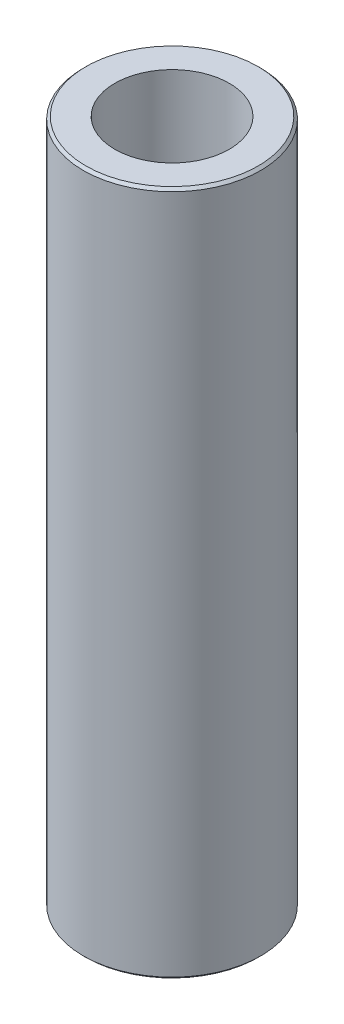
ISO-10303-21;
HEADER;
FILE_DESCRIPTION(('STEP AP214'),'2;1');
FILE_NAME('part.step','',(''),(''),'','','');
FILE_SCHEMA(('AUTOMOTIVE_DESIGN { 1 0 10303 214 1 1 1 1 }'));
ENDSEC;
DATA;
#1=APPLICATION_CONTEXT('core data for automotive mechanical design processes');
#2=APPLICATION_PROTOCOL_DEFINITION('international standard','automotive_design',2000,#1);
#3=PRODUCT_CONTEXT('',#1,'mechanical');
#4=PRODUCT('Part','Part','',(#3));
#5=PRODUCT_RELATED_PRODUCT_CATEGORY('part','',(#4));
#6=PRODUCT_DEFINITION_FORMATION('','',#4);
#7=PRODUCT_DEFINITION_CONTEXT('part definition',#1,'design');
#8=PRODUCT_DEFINITION('design','',#6,#7);
#9=PRODUCT_DEFINITION_SHAPE('','',#8);
#10=(LENGTH_UNIT() NAMED_UNIT(*) SI_UNIT(.MILLI.,.METRE.));
#11=(NAMED_UNIT(*) PLANE_ANGLE_UNIT() SI_UNIT($,.RADIAN.));
#12=(NAMED_UNIT(*) SI_UNIT($,.STERADIAN.) SOLID_ANGLE_UNIT());
#13=UNCERTAINTY_MEASURE_WITH_UNIT(LENGTH_MEASURE(1.E-05),#10,'distance_accuracy_value','');
#14=(GEOMETRIC_REPRESENTATION_CONTEXT(3) GLOBAL_UNCERTAINTY_ASSIGNED_CONTEXT((#13)) GLOBAL_UNIT_ASSIGNED_CONTEXT((#10,
#11,#12)) REPRESENTATION_CONTEXT('',''));
#15=CARTESIAN_POINT('',(0.,0.,0.));
#16=DIRECTION('',(0.,0.,1.));
#17=DIRECTION('',(1.,0.,0.));
#18=AXIS2_PLACEMENT_3D('',#15,#16,#17);
#19=CARTESIAN_POINT('',(0.,115.916558369665,0.));
#20=DIRECTION('',(0.,-1.,0.));
#21=DIRECTION('',(0.,0.,-1.));
#22=AXIS2_PLACEMENT_3D('',#19,#20,#21);
#23=CYLINDRICAL_SURFACE('',#22,15.);
#24=CARTESIAN_POINT('',(0.,115.471644562709,0.));
#25=DIRECTION('',(0.,1.,0.));
#26=DIRECTION('',(0.,0.,1.));
#27=AXIS2_PLACEMENT_3D('',#24,#25,#26);
#28=CIRCLE('',#27,15.);
#29=CARTESIAN_POINT('',(0.,115.471644562709,15.));
#30=VERTEX_POINT('',#29);
#31=EDGE_CURVE('E50',#30,#30,#28,.F.);
#32=ORIENTED_EDGE('',*,*,#31,.T.);
#33=EDGE_LOOP('',(#32));
#34=FACE_BOUND('',#33,.T.);
#35=CARTESIAN_POINT('',(0.,0.436372822652339,0.));
#36=DIRECTION('',(0.,1.,0.));
#37=DIRECTION('',(0.,0.,1.));
#38=AXIS2_PLACEMENT_3D('',#35,#36,#37);
#39=CIRCLE('',#38,15.);
#40=CARTESIAN_POINT('',(0.,0.436372822652339,15.));
#41=VERTEX_POINT('',#40);
#42=EDGE_CURVE('E51',#41,#41,#39,.T.);
#43=ORIENTED_EDGE('',*,*,#42,.T.);
#44=EDGE_LOOP('',(#43));
#45=FACE_BOUND('',#44,.T.);
#46=ADVANCED_FACE('F39',(#34,#45),#23,.T.);
#47=CARTESIAN_POINT('',(0.,115.916558369665,0.));
#48=DIRECTION('',(0.,1.,0.));
#49=DIRECTION('',(0.,0.,1.));
#50=AXIS2_PLACEMENT_3D('',#47,#48,#49);
#51=PLANE('',#50);
#52=CARTESIAN_POINT('',(0.,115.916558369665,0.));
#53=DIRECTION('',(0.,1.,0.));
#54=DIRECTION('',(0.,0.,1.));
#55=AXIS2_PLACEMENT_3D('',#52,#53,#54);
#56=CIRCLE('',#55,14.5636271773477);
#57=CARTESIAN_POINT('',(0.,115.916558369665,14.5636271773477));
#58=VERTEX_POINT('',#57);
#59=EDGE_CURVE('E54',#58,#58,#56,.T.);
#60=ORIENTED_EDGE('',*,*,#59,.T.);
#61=EDGE_LOOP('',(#60));
#62=FACE_BOUND('',#61,.T.);
#63=CARTESIAN_POINT('',(0.,115.916558369665,0.));
#64=DIRECTION('',(0.,1.,0.));
#65=DIRECTION('',(0.,0.,1.));
#66=AXIS2_PLACEMENT_3D('',#63,#64,#65);
#67=CIRCLE('',#66,9.68020169525517);
#68=CARTESIAN_POINT('',(0.,115.916558369665,9.68020169525517));
#69=VERTEX_POINT('',#68);
#70=EDGE_CURVE('E58',#69,#69,#67,.T.);
#71=ORIENTED_EDGE('',*,*,#70,.F.);
#72=EDGE_LOOP('',(#71));
#73=FACE_BOUND('',#72,.T.);
#74=ADVANCED_FACE('F69',(#62,#73),#51,.T.);
#75=CARTESIAN_POINT('',(0.,0.,0.));
#76=DIRECTION('',(0.,1.,0.));
#77=DIRECTION('',(0.,0.,1.));
#78=AXIS2_PLACEMENT_3D('',#75,#76,#77);
#79=PLANE('',#78);
#80=CARTESIAN_POINT('',(0.,0.,0.));
#81=DIRECTION('',(0.,1.,0.));
#82=DIRECTION('',(0.,0.,1.));
#83=AXIS2_PLACEMENT_3D('',#80,#81,#82);
#84=CIRCLE('',#83,14.5550861930446);
#85=CARTESIAN_POINT('',(0.,0.,14.5550861930446));
#86=VERTEX_POINT('',#85);
#87=EDGE_CURVE('E10',#86,#86,#84,.F.);
#88=ORIENTED_EDGE('',*,*,#87,.T.);
#89=EDGE_LOOP('',(#88));
#90=FACE_BOUND('',#89,.T.);
#91=CARTESIAN_POINT('',(0.,0.,0.));
#92=DIRECTION('',(0.,1.,0.));
#93=DIRECTION('',(0.,0.,1.));
#94=AXIS2_PLACEMENT_3D('',#91,#92,#93);
#95=CIRCLE('',#94,9.68020169525517);
#96=CARTESIAN_POINT('',(0.,0.,9.68020169525517));
#97=VERTEX_POINT('',#96);
#98=EDGE_CURVE('E63',#97,#97,#95,.T.);
#99=ORIENTED_EDGE('',*,*,#98,.T.);
#100=EDGE_LOOP('',(#99));
#101=FACE_BOUND('',#100,.T.);
#102=ADVANCED_FACE('F75',(#90,#101),#79,.F.);
#103=CARTESIAN_POINT('',(0.,115.916558369665,0.));
#104=DIRECTION('',(0.,-1.,0.));
#105=DIRECTION('',(0.,0.,-1.));
#106=AXIS2_PLACEMENT_3D('',#103,#104,#105);
#107=CYLINDRICAL_SURFACE('',#106,9.68020169525517);
#108=ORIENTED_EDGE('',*,*,#70,.T.);
#109=EDGE_LOOP('',(#108));
#110=FACE_BOUND('',#109,.T.);
#111=ORIENTED_EDGE('',*,*,#98,.F.);
#112=EDGE_LOOP('',(#111));
#113=FACE_BOUND('',#112,.T.);
#114=ADVANCED_FACE('F70',(#110,#113),#107,.F.);
#115=CARTESIAN_POINT('',(0.,115.916558369665,0.));
#116=DIRECTION('',(0.,-1.,0.));
#117=DIRECTION('',(0.,0.,-1.));
#118=AXIS2_PLACEMENT_3D('',#115,#116,#117);
#119=CONICAL_SURFACE('',#118,14.5636271773477,0.775706972555519);
#120=ORIENTED_EDGE('',*,*,#31,.F.);
#121=EDGE_LOOP('',(#120));
#122=FACE_BOUND('',#121,.T.);
#123=ORIENTED_EDGE('',*,*,#59,.F.);
#124=EDGE_LOOP('',(#123));
#125=FACE_BOUND('',#124,.T.);
#126=ADVANCED_FACE('F81',(#122,#125),#119,.T.);
#127=CARTESIAN_POINT('',(0.,0.436372822652339,0.));
#128=DIRECTION('',(0.,1.,0.));
#129=DIRECTION('',(0.,0.,1.));
#130=AXIS2_PLACEMENT_3D('',#127,#128,#129);
#131=CONICAL_SURFACE('',#130,15.,0.795089354239393);
#132=ORIENTED_EDGE('',*,*,#87,.F.);
#133=EDGE_LOOP('',(#132));
#134=FACE_BOUND('',#133,.T.);
#135=ORIENTED_EDGE('',*,*,#42,.F.);
#136=EDGE_LOOP('',(#135));
#137=FACE_BOUND('',#136,.T.);
#138=ADVANCED_FACE('F45',(#134,#137),#131,.T.);
#139=CLOSED_SHELL('',(#46,#74,#102,#114,#126,#138));
#140=MANIFOLD_SOLID_BREP('B2',#139);
#141=ADVANCED_BREP_SHAPE_REPRESENTATION('',(#18,#140),#14);
#142=SHAPE_DEFINITION_REPRESENTATION(#9,#141);
ENDSEC;
END-ISO-10303-21;
